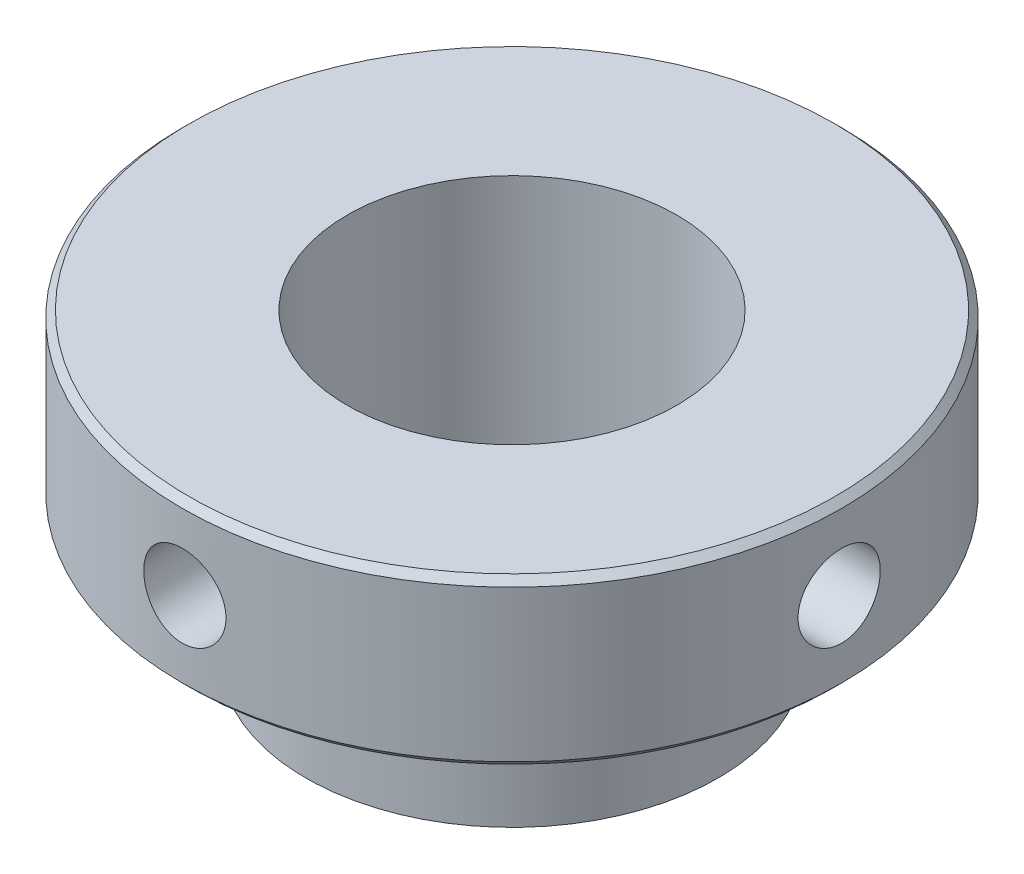
ISO-10303-21;
HEADER;
FILE_DESCRIPTION(('STEP AP214'),'2;1');
FILE_NAME('part.step','',(''),(''),'','','');
FILE_SCHEMA(('AUTOMOTIVE_DESIGN { 1 0 10303 214 1 1 1 1 }'));
ENDSEC;
DATA;
#1=APPLICATION_CONTEXT('core data for automotive mechanical design processes');
#2=APPLICATION_PROTOCOL_DEFINITION('international standard','automotive_design',2000,#1);
#3=PRODUCT_CONTEXT('',#1,'mechanical');
#4=PRODUCT('Part','Part','',(#3));
#5=PRODUCT_RELATED_PRODUCT_CATEGORY('part','',(#4));
#6=PRODUCT_DEFINITION_FORMATION('','',#4);
#7=PRODUCT_DEFINITION_CONTEXT('part definition',#1,'design');
#8=PRODUCT_DEFINITION('design','',#6,#7);
#9=PRODUCT_DEFINITION_SHAPE('','',#8);
#10=(LENGTH_UNIT() NAMED_UNIT(*) SI_UNIT(.MILLI.,.METRE.));
#11=(NAMED_UNIT(*) PLANE_ANGLE_UNIT() SI_UNIT($,.RADIAN.));
#12=(NAMED_UNIT(*) SI_UNIT($,.STERADIAN.) SOLID_ANGLE_UNIT());
#13=UNCERTAINTY_MEASURE_WITH_UNIT(LENGTH_MEASURE(1.E-05),#10,'distance_accuracy_value','');
#14=(GEOMETRIC_REPRESENTATION_CONTEXT(3) GLOBAL_UNCERTAINTY_ASSIGNED_CONTEXT((#13)) GLOBAL_UNIT_ASSIGNED_CONTEXT((#10,
#11,#12)) REPRESENTATION_CONTEXT('',''));
#15=CARTESIAN_POINT('',(0.,0.,0.));
#16=DIRECTION('',(0.,0.,1.));
#17=DIRECTION('',(1.,0.,0.));
#18=AXIS2_PLACEMENT_3D('',#15,#16,#17);
#19=CARTESIAN_POINT('',(0.,0.,0.));
#20=DIRECTION('',(0.,-1.,0.));
#21=DIRECTION('',(0.,0.,-1.));
#22=AXIS2_PLACEMENT_3D('',#19,#20,#21);
#23=CYLINDRICAL_SURFACE('',#22,3.);
#24=CARTESIAN_POINT('',(2.97659604246193,2.,-0.374));
#25=CARTESIAN_POINT('',(2.9765963422719,1.97908002096411,-0.373999110309325));
#26=CARTESIAN_POINT('',(2.97681896704147,1.95814695575955,-0.372238814554709));
#27=CARTESIAN_POINT('',(2.97768507797581,1.91686336385683,-0.365244460648864));
#28=CARTESIAN_POINT('',(2.97832900426937,1.89651346962265,-0.360006769618858));
#29=CARTESIAN_POINT('',(2.9799636748581,1.8569999178447,-0.346214406960289));
#30=CARTESIAN_POINT('',(2.98095418409294,1.83783546664757,-0.337661983035738));
#31=CARTESIAN_POINT('',(2.98317013177889,1.80121736972644,-0.317487728900767));
#32=CARTESIAN_POINT('',(2.98439552996269,1.783763431541,-0.305866424663567));
#33=CARTESIAN_POINT('',(2.98695082448385,1.75096106298891,-0.279814985764893));
#34=CARTESIAN_POINT('',(2.98828121009916,1.73562353282838,-0.265371172713526));
#35=CARTESIAN_POINT('',(2.99089217758698,1.70758350768693,-0.234114162677506));
#36=CARTESIAN_POINT('',(2.9921727569822,1.69488114364038,-0.217300848028311));
#37=CARTESIAN_POINT('',(2.99454482864878,1.67243295131177,-0.181713625519564));
#38=CARTESIAN_POINT('',(2.99563568518879,1.66269698403908,-0.162933451418036));
#39=CARTESIAN_POINT('',(2.99750002464498,1.6465211137916,-0.123988774347822));
#40=CARTESIAN_POINT('',(2.99827351928006,1.64008108910868,-0.103824322527073));
#41=CARTESIAN_POINT('',(2.99941253748433,1.63071246964524,-0.0627949384780372));
#42=CARTESIAN_POINT('',(2.99978016543772,1.62776575640893,-0.0419342027587658));
#43=CARTESIAN_POINT('',(3.00007321402063,1.62541125586951,-1.12977531221159E-05));
#44=CARTESIAN_POINT('',(2.99999865195891,1.62600333004675,0.0210508636165751));
#45=CARTESIAN_POINT('',(2.99941742466199,1.63069507421044,0.0626554740730173));
#46=CARTESIAN_POINT('',(2.99891315996738,1.63477525822432,0.0832001588427727));
#47=CARTESIAN_POINT('',(2.99753188538731,1.64629694157758,0.123310901643888));
#48=CARTESIAN_POINT('',(2.99665486844761,1.6537385045303,0.142876941146827));
#49=CARTESIAN_POINT('',(2.99462250037944,1.67179243855339,0.180535325882905));
#50=CARTESIAN_POINT('',(2.99346641038458,1.68241324512918,0.198623585527014));
#51=CARTESIAN_POINT('',(2.99100524293599,1.70651804417715,0.232768383354013));
#52=CARTESIAN_POINT('',(2.98970015868685,1.72000216726497,0.248824828798488));
#53=CARTESIAN_POINT('',(2.98707659092304,1.74955997814411,0.278564687848935));
#54=CARTESIAN_POINT('',(2.98575807663327,1.76565064749604,0.292231226667685));
#55=CARTESIAN_POINT('',(2.9832650121254,1.79990645204658,0.316672186233087));
#56=CARTESIAN_POINT('',(2.98209046235424,1.8180715936852,0.327446598001055));
#57=CARTESIAN_POINT('',(2.98001832245345,1.85597570797535,0.345798408292956));
#58=CARTESIAN_POINT('',(2.97912084909504,1.87571533978283,0.353374459391067));
#59=CARTESIAN_POINT('',(2.97770675449528,1.91620030678288,0.365099549784297));
#60=CARTESIAN_POINT('',(2.97719011500078,1.93694559372418,0.369248753327407));
#61=CARTESIAN_POINT('',(2.97659951650018,1.9787039642979,0.373980028919209));
#62=CARTESIAN_POINT('',(2.97652261069209,1.99971431738133,0.374585847004368));
#63=CARTESIAN_POINT('',(2.9768123936368,2.0415370202136,0.372275804941478));
#64=CARTESIAN_POINT('',(2.97717907298625,2.06234937415031,0.369360019446307));
#65=CARTESIAN_POINT('',(2.97831202162864,2.10311415862273,0.360109530306638));
#66=CARTESIAN_POINT('',(2.97907694721078,2.12306923807232,0.35378632105132));
#67=CARTESIAN_POINT('',(2.98091911043126,2.16163588408346,0.337912307992426));
#68=CARTESIAN_POINT('',(2.98199635898695,2.18024740365211,0.328361391361537));
#69=CARTESIAN_POINT('',(2.98434884846455,2.21570606327593,0.306244678601096));
#70=CARTESIAN_POINT('',(2.98562509976905,2.23254342090922,0.293663308010206));
#71=CARTESIAN_POINT('',(2.98822861820608,2.26387600208658,0.265864847201817));
#72=CARTESIAN_POINT('',(2.98955588731067,2.27837113498099,0.250647655018965));
#73=CARTESIAN_POINT('',(2.99212094044646,2.30469119679681,0.217905790163987));
#74=CARTESIAN_POINT('',(2.99335817458228,2.31650052386837,0.200368526463806));
#75=CARTESIAN_POINT('',(2.99559553374754,2.3370058038405,0.163545583795214));
#76=CARTESIAN_POINT('',(2.99659566353432,2.34570181920934,0.144259939917595));
#77=CARTESIAN_POINT('',(2.99824368451605,2.35970785437416,0.104539569135229));
#78=CARTESIAN_POINT('',(2.99889251365513,2.36502689703963,0.0841080643633984));
#79=CARTESIAN_POINT('',(2.99976872173339,2.37215735191806,0.0426333380772617));
#80=CARTESIAN_POINT('',(2.99999611957106,2.37396892141888,0.0215901440362809));
#81=CARTESIAN_POINT('',(3.00000375559385,2.37403007755408,-0.0203582668458081));
#82=CARTESIAN_POINT('',(2.99978701418194,2.37230372409666,-0.0412634521444337));
#83=CARTESIAN_POINT('',(2.99893672838106,2.36538898941673,-0.0824841152228694));
#84=CARTESIAN_POINT('',(2.99830318427124,2.36020061051278,-0.102799593397607));
#85=CARTESIAN_POINT('',(2.99669016687359,2.34651664588869,-0.142261051211945));
#86=CARTESIAN_POINT('',(2.99571081345379,2.33802220604561,-0.161407433401814));
#87=CARTESIAN_POINT('',(2.99351463161352,2.31796973875746,-0.198006768257339));
#88=CARTESIAN_POINT('',(2.99229780043085,2.30641167567767,-0.215459701222317));
#89=CARTESIAN_POINT('',(2.98975262511752,2.28047101690636,-0.248299636922905));
#90=CARTESIAN_POINT('',(2.98842360642369,2.26607051821591,-0.263672446401855));
#91=CARTESIAN_POINT('',(2.98580926209895,2.23489092445359,-0.291792793696697));
#92=CARTESIAN_POINT('',(2.98452394689405,2.21811126667212,-0.304539708691603));
#93=CARTESIAN_POINT('',(2.98213727308625,2.18257578897051,-0.327088260193843));
#94=CARTESIAN_POINT('',(2.98103664009431,2.16381262548976,-0.336878394712667));
#95=CARTESIAN_POINT('',(2.97915245638795,2.12490534261998,-0.353154891762453));
#96=CARTESIAN_POINT('',(2.97836856081294,2.10476275324416,-0.359644849495394));
#97=CARTESIAN_POINT('',(2.97739704926068,2.07042981465918,-0.367582077097384));
#98=CARTESIAN_POINT('',(2.97709816661237,2.05645606757413,-0.369985339637448));
#99=CARTESIAN_POINT('',(2.97669756245576,2.02832354586978,-0.373194596276032));
#100=CARTESIAN_POINT('',(2.97659583946267,2.01416477264471,-0.374000602403383));
#101=CARTESIAN_POINT('',(2.97659604246193,2.,-0.374));
#102=B_SPLINE_CURVE_WITH_KNOTS('',3,(#24,#25,#26,#27,#28,#29,#30,#31,#32,#33,#34,#35,#36,#37,
#38,#39,#40,#41,#42,#43,#44,#45,#46,#47,#48,#49,#50,#51,#52,#53,#54,#55,#56,#57,#58,#59,#60,#61,
#62,#63,#64,#65,#66,#67,#68,#69,#70,#71,#72,#73,#74,#75,#76,#77,#78,#79,#80,#81,#82,#83,#84,#85,
#86,#87,#88,#89,#90,#91,#92,#93,#94,#95,#96,#97,#98,#99,#100,#101),.UNSPECIFIED.,.T.,.F.,(4,2,2,
2,2,2,2,2,2,2,2,2,2,2,2,2,2,2,2,2,2,2,2,2,2,2,2,2,2,2,2,2,2,2,2,2,2,2,4),(0.,0.0627081910267501,
0.12548199739714,0.188213311423225,0.250933880943967,0.313966301159942,0.377001852539022,
0.440244718622654,0.503485249190176,0.566396320192973,0.62930492866815,0.691864384010811,
0.754425023326458,0.817153149078171,0.879884136907698,0.943041591862344,1.00619924288867,
1.06938347488587,1.13256467830203,1.19532198265547,1.25807795666862,1.32062354684867,
1.38317132359029,1.44604768198915,1.50892647326989,1.5721616939239,1.63539564569893,
1.69845992484583,1.76152137589576,1.82415539617802,1.88678937451328,1.94940166328554,
2.0120146803682,2.07503542815998,2.13807110631822,2.20134892761232,2.26455766577012,
2.30701726655353,2.34947654757532),.UNSPECIFIED.);
#103=CARTESIAN_POINT('',(2.97659604246193,2.,-0.374));
#104=VERTEX_POINT('',#103);
#105=EDGE_CURVE('E112',#104,#104,#102,.T.);
#106=ORIENTED_EDGE('',*,*,#105,.T.);
#107=EDGE_LOOP('',(#106));
#108=FACE_BOUND('',#107,.T.);
#109=CARTESIAN_POINT('',(-2.97659604246193,2.,0.374));
#110=CARTESIAN_POINT('',(-2.9765963422719,1.97908002096411,0.373999110309325));
#111=CARTESIAN_POINT('',(-2.97681896704147,1.95814695575955,0.372238814554709));
#112=CARTESIAN_POINT('',(-2.97768507797581,1.91686336385683,0.365244460648864));
#113=CARTESIAN_POINT('',(-2.97832900426937,1.89651346962265,0.360006769618858));
#114=CARTESIAN_POINT('',(-2.9799636748581,1.8569999178447,0.346214406960289));
#115=CARTESIAN_POINT('',(-2.98095418409294,1.83783546664757,0.337661983035738));
#116=CARTESIAN_POINT('',(-2.98317013177889,1.80121736972644,0.317487728900767));
#117=CARTESIAN_POINT('',(-2.98439552996269,1.783763431541,0.305866424663567));
#118=CARTESIAN_POINT('',(-2.98695082448385,1.75096106298891,0.279814985764893));
#119=CARTESIAN_POINT('',(-2.98828121009916,1.73562353282838,0.265371172713526));
#120=CARTESIAN_POINT('',(-2.99089217758698,1.70758350768693,0.234114162677506));
#121=CARTESIAN_POINT('',(-2.9921727569822,1.69488114364038,0.217300848028311));
#122=CARTESIAN_POINT('',(-2.99454482864878,1.67243295131177,0.181713625519564));
#123=CARTESIAN_POINT('',(-2.99563568518879,1.66269698403908,0.162933451418036));
#124=CARTESIAN_POINT('',(-2.99750002464498,1.6465211137916,0.123988774347822));
#125=CARTESIAN_POINT('',(-2.99827351928006,1.64008108910868,0.103824322527073));
#126=CARTESIAN_POINT('',(-2.99941253748433,1.63071246964524,0.0627949384780372));
#127=CARTESIAN_POINT('',(-2.99978016543772,1.62776575640893,0.0419342027587658));
#128=CARTESIAN_POINT('',(-3.00007321402063,1.62541125586951,1.12977531221159E-05));
#129=CARTESIAN_POINT('',(-2.99999865195891,1.62600333004675,-0.0210508636165751));
#130=CARTESIAN_POINT('',(-2.99941742466199,1.63069507421044,-0.0626554740730173));
#131=CARTESIAN_POINT('',(-2.99891315996738,1.63477525822432,-0.0832001588427727));
#132=CARTESIAN_POINT('',(-2.99753188538731,1.64629694157758,-0.123310901643888));
#133=CARTESIAN_POINT('',(-2.99665486844761,1.6537385045303,-0.142876941146827));
#134=CARTESIAN_POINT('',(-2.99462250037944,1.67179243855339,-0.180535325882905));
#135=CARTESIAN_POINT('',(-2.99346641038458,1.68241324512918,-0.198623585527014));
#136=CARTESIAN_POINT('',(-2.99100524293599,1.70651804417715,-0.232768383354013));
#137=CARTESIAN_POINT('',(-2.98970015868685,1.72000216726497,-0.248824828798488));
#138=CARTESIAN_POINT('',(-2.98707659092304,1.74955997814411,-0.278564687848935));
#139=CARTESIAN_POINT('',(-2.98575807663327,1.76565064749604,-0.292231226667685));
#140=CARTESIAN_POINT('',(-2.9832650121254,1.79990645204658,-0.316672186233087));
#141=CARTESIAN_POINT('',(-2.98209046235424,1.8180715936852,-0.327446598001055));
#142=CARTESIAN_POINT('',(-2.98001832245345,1.85597570797535,-0.345798408292956));
#143=CARTESIAN_POINT('',(-2.97912084909504,1.87571533978283,-0.353374459391067));
#144=CARTESIAN_POINT('',(-2.97770675449528,1.91620030678288,-0.365099549784297));
#145=CARTESIAN_POINT('',(-2.97719011500078,1.93694559372418,-0.369248753327407));
#146=CARTESIAN_POINT('',(-2.97659951650018,1.9787039642979,-0.373980028919209));
#147=CARTESIAN_POINT('',(-2.97652261069209,1.99971431738133,-0.374585847004368));
#148=CARTESIAN_POINT('',(-2.9768123936368,2.0415370202136,-0.372275804941478));
#149=CARTESIAN_POINT('',(-2.97717907298625,2.06234937415031,-0.369360019446307));
#150=CARTESIAN_POINT('',(-2.97831202162864,2.10311415862273,-0.360109530306638));
#151=CARTESIAN_POINT('',(-2.97907694721078,2.12306923807232,-0.35378632105132));
#152=CARTESIAN_POINT('',(-2.98091911043126,2.16163588408346,-0.337912307992426));
#153=CARTESIAN_POINT('',(-2.98199635898695,2.18024740365211,-0.328361391361537));
#154=CARTESIAN_POINT('',(-2.98434884846455,2.21570606327593,-0.306244678601096));
#155=CARTESIAN_POINT('',(-2.98562509976905,2.23254342090922,-0.293663308010206));
#156=CARTESIAN_POINT('',(-2.98822861820608,2.26387600208658,-0.265864847201817));
#157=CARTESIAN_POINT('',(-2.98955588731067,2.27837113498099,-0.250647655018965));
#158=CARTESIAN_POINT('',(-2.99212094044646,2.30469119679681,-0.217905790163987));
#159=CARTESIAN_POINT('',(-2.99335817458228,2.31650052386837,-0.200368526463806));
#160=CARTESIAN_POINT('',(-2.99559553374754,2.3370058038405,-0.163545583795214));
#161=CARTESIAN_POINT('',(-2.99659566353432,2.34570181920934,-0.144259939917595));
#162=CARTESIAN_POINT('',(-2.99824368451605,2.35970785437416,-0.104539569135229));
#163=CARTESIAN_POINT('',(-2.99889251365513,2.36502689703963,-0.0841080643633984));
#164=CARTESIAN_POINT('',(-2.99976872173339,2.37215735191806,-0.0426333380772617));
#165=CARTESIAN_POINT('',(-2.99999611957106,2.37396892141888,-0.0215901440362809));
#166=CARTESIAN_POINT('',(-3.00000375559385,2.37403007755408,0.0203582668458081));
#167=CARTESIAN_POINT('',(-2.99978701418194,2.37230372409666,0.0412634521444337));
#168=CARTESIAN_POINT('',(-2.99893672838106,2.36538898941673,0.0824841152228694));
#169=CARTESIAN_POINT('',(-2.99830318427124,2.36020061051278,0.102799593397607));
#170=CARTESIAN_POINT('',(-2.99669016687359,2.34651664588869,0.142261051211945));
#171=CARTESIAN_POINT('',(-2.99571081345379,2.33802220604561,0.161407433401814));
#172=CARTESIAN_POINT('',(-2.99351463161352,2.31796973875746,0.198006768257339));
#173=CARTESIAN_POINT('',(-2.99229780043085,2.30641167567767,0.215459701222317));
#174=CARTESIAN_POINT('',(-2.98975262511752,2.28047101690636,0.248299636922905));
#175=CARTESIAN_POINT('',(-2.98842360642369,2.26607051821591,0.263672446401855));
#176=CARTESIAN_POINT('',(-2.98580926209895,2.23489092445359,0.291792793696697));
#177=CARTESIAN_POINT('',(-2.98452394689405,2.21811126667212,0.304539708691603));
#178=CARTESIAN_POINT('',(-2.98213727308625,2.18257578897051,0.327088260193843));
#179=CARTESIAN_POINT('',(-2.98103664009431,2.16381262548976,0.336878394712667));
#180=CARTESIAN_POINT('',(-2.97915245638795,2.12490534261998,0.353154891762453));
#181=CARTESIAN_POINT('',(-2.97836856081294,2.10476275324416,0.359644849495394));
#182=CARTESIAN_POINT('',(-2.97739704926068,2.07042981465918,0.367582077097384));
#183=CARTESIAN_POINT('',(-2.97709816661237,2.05645606757413,0.369985339637448));
#184=CARTESIAN_POINT('',(-2.97669756245576,2.02832354586978,0.373194596276032));
#185=CARTESIAN_POINT('',(-2.97659583946267,2.01416477264471,0.374000602403383));
#186=CARTESIAN_POINT('',(-2.97659604246193,2.,0.374));
#187=B_SPLINE_CURVE_WITH_KNOTS('',3,(#109,#110,#111,#112,#113,#114,#115,#116,#117,#118,#119,
#120,#121,#122,#123,#124,#125,#126,#127,#128,#129,#130,#131,#132,#133,#134,#135,#136,#137,#138,
#139,#140,#141,#142,#143,#144,#145,#146,#147,#148,#149,#150,#151,#152,#153,#154,#155,#156,#157,
#158,#159,#160,#161,#162,#163,#164,#165,#166,#167,#168,#169,#170,#171,#172,#173,#174,#175,#176,
#177,#178,#179,#180,#181,#182,#183,#184,#185,#186),.UNSPECIFIED.,.T.,.F.,(4,2,2,2,2,2,2,2,2,2,2,
2,2,2,2,2,2,2,2,2,2,2,2,2,2,2,2,2,2,2,2,2,2,2,2,2,2,2,4),(0.,0.0627081910267501,
0.12548199739714,0.188213311423225,0.250933880943967,0.313966301159942,0.377001852539022,
0.440244718622654,0.503485249190176,0.566396320192973,0.62930492866815,0.691864384010811,
0.754425023326458,0.817153149078171,0.879884136907698,0.943041591862344,1.00619924288867,
1.06938347488587,1.13256467830203,1.19532198265547,1.25807795666862,1.32062354684867,
1.38317132359029,1.44604768198915,1.50892647326989,1.5721616939239,1.63539564569893,
1.69845992484583,1.76152137589576,1.82415539617802,1.88678937451328,1.94940166328554,
2.0120146803682,2.07503542815998,2.13807110631822,2.20134892761232,2.26455766577012,
2.30701726655353,2.34947654757532),.UNSPECIFIED.);
#188=CARTESIAN_POINT('',(-2.97659604246193,2.,0.374));
#189=VERTEX_POINT('',#188);
#190=EDGE_CURVE('E100',#189,#189,#187,.T.);
#191=ORIENTED_EDGE('',*,*,#190,.T.);
#192=EDGE_LOOP('',(#191));
#193=FACE_BOUND('',#192,.T.);
#194=CARTESIAN_POINT('',(0.,2.688,0.));
#195=DIRECTION('',(0.,-1.,0.));
#196=DIRECTION('',(0.,0.,-1.));
#197=AXIS2_PLACEMENT_3D('',#194,#195,#196);
#198=CIRCLE('',#197,3.);
#199=CARTESIAN_POINT('',(0.,2.688,-3.));
#200=VERTEX_POINT('',#199);
#201=EDGE_CURVE('E166',#200,#200,#198,.T.);
#202=ORIENTED_EDGE('',*,*,#201,.T.);
#203=EDGE_LOOP('',(#202));
#204=FACE_BOUND('',#203,.T.);
#205=CARTESIAN_POINT('',(0.,1.312,0.));
#206=DIRECTION('',(0.,-1.,0.));
#207=DIRECTION('',(0.,0.,-1.));
#208=AXIS2_PLACEMENT_3D('',#205,#206,#207);
#209=CIRCLE('',#208,3.);
#210=CARTESIAN_POINT('',(0.,1.312,-3.));
#211=VERTEX_POINT('',#210);
#212=EDGE_CURVE('E158',#211,#211,#209,.T.);
#213=ORIENTED_EDGE('',*,*,#212,.F.);
#214=EDGE_LOOP('',(#213));
#215=FACE_BOUND('',#214,.T.);
#216=CARTESIAN_POINT('',(0.,2.374,-3.));
#217=CARTESIAN_POINT('',(-0.0209206912447897,2.37399911093565,-2.99999970875538));
#218=CARTESIAN_POINT('',(-0.041854466564667,2.37223869936918,-2.99977885096707));
#219=CARTESIAN_POINT('',(-0.0831395337639532,2.36524384366907,-2.99891904960694));
#220=CARTESIAN_POINT('',(-0.103490193740075,2.360005769166,-2.99827966914465));
#221=CARTESIAN_POINT('',(-0.143005365165185,2.3462122848672,-2.99665485422549));
#222=CARTESIAN_POINT('',(-0.162170663784758,2.33765910458859,-2.99566965238673));
#223=CARTESIAN_POINT('',(-0.198790182351024,2.31748306894102,-2.99346277789071));
#224=CARTESIAN_POINT('',(-0.216244695800104,2.30586074138349,-2.99224114590277));
#225=CARTESIAN_POINT('',(-0.249046421902186,2.27980826578294,-2.98969033035591));
#226=CARTESIAN_POINT('',(-0.264382914875163,2.26536466824449,-2.9883606501821));
#227=CARTESIAN_POINT('',(-0.292420936183478,2.23410852567968,-2.98574760728332));
#228=CARTESIAN_POINT('',(-0.305122330400318,2.21729586014808,-2.98446424691863));
#229=CARTESIAN_POINT('',(-0.327569502921966,2.18170921345759,-2.9820842569232));
#230=CARTESIAN_POINT('',(-0.337305243654575,2.16292885439118,-2.98098826683936));
#231=CARTESIAN_POINT('',(-0.353480644153368,2.1239837755305,-2.97911364988601));
#232=CARTESIAN_POINT('',(-0.359920428258781,2.10381910799153,-2.97833501104472));
#233=CARTESIAN_POINT('',(-0.3692885533571,2.06278903466297,-2.97718799363862));
#234=CARTESIAN_POINT('',(-0.372234988938892,2.04192782040117,-2.97681750169869));
#235=CARTESIAN_POINT('',(-0.374588768335433,2.00000397628447,-2.97652225649842));
#236=CARTESIAN_POINT('',(-0.373996253738406,1.97894135452124,-2.97659748540542));
#237=CARTESIAN_POINT('',(-0.369303806600248,1.93733867109031,-2.97718324807485));
#238=CARTESIAN_POINT('',(-0.365223803580784,1.91679632175769,-2.97769130833427));
#239=CARTESIAN_POINT('',(-0.353703289523987,1.87669015616448,-2.97908162971462));
#240=CARTESIAN_POINT('',(-0.346262710730996,1.85712635964223,-2.97996389838028));
#241=CARTESIAN_POINT('',(-0.328210826066133,1.81947071591669,-2.98200603164207));
#242=CARTESIAN_POINT('',(-0.317590856991984,1.8013830645112,-2.98316665295244));
#243=CARTESIAN_POINT('',(-0.293487851665837,1.76723912911846,-2.98563413214075));
#244=CARTESIAN_POINT('',(-0.280004685152017,1.751182937606,-2.98694099667077));
#245=CARTESIAN_POINT('',(-0.250447559914594,1.72144201936917,-2.98956470640396));
#246=CARTESIAN_POINT('',(-0.234356422552244,1.70777435993261,-2.99088155844042));
#247=CARTESIAN_POINT('',(-0.200099279822698,1.68333136133428,-2.99336845662882));
#248=CARTESIAN_POINT('',(-0.181933269714494,1.67255602878156,-2.9945385024453));
#249=CARTESIAN_POINT('',(-0.144028905381121,1.65420355321203,-2.99660067638884));
#250=CARTESIAN_POINT('',(-0.124290029814825,1.64662747590432,-2.99749271188154));
#251=CARTESIAN_POINT('',(-0.0838067087876765,1.63490210202707,-2.99889751453592));
#252=CARTESIAN_POINT('',(-0.063062310199059,1.63075264588866,-2.9994102993582));
#253=CARTESIAN_POINT('',(-0.0213043761304926,1.62602041591158,-2.9999965281996));
#254=CARTESIAN_POINT('',(-0.000293544172885351,1.62541413038067,-3.0000728682952));
#255=CARTESIAN_POINT('',(0.0415302281507634,1.62772340845586,-2.99978542468937));
#256=CARTESIAN_POINT('',(0.062343172698754,1.63063889746893,-2.99942165030981));
#257=CARTESIAN_POINT('',(0.103111013955605,1.63988943304573,-2.99829665874524));
#258=CARTESIAN_POINT('',(0.123068492786546,1.64621327192813,-2.99753674445469));
#259=CARTESIAN_POINT('',(0.161639659586872,1.66208934628217,-2.99570455454915));
#260=CARTESIAN_POINT('',(0.180253302123682,1.67164169084152,-2.99463226837962));
#261=CARTESIAN_POINT('',(0.215713446053781,1.69376052646705,-2.99228766987947));
#262=CARTESIAN_POINT('',(0.232550391448334,1.70634222977601,-2.99101435956522));
#263=CARTESIAN_POINT('',(0.26388198626782,1.73414110884769,-2.98841327981736));
#264=CARTESIAN_POINT('',(0.278376543187384,1.7493583886452,-2.98708550823556));
#265=CARTESIAN_POINT('',(0.304695306283149,1.78210001015028,-2.98451622242239));
#266=CARTESIAN_POINT('',(0.316503929457945,1.79963692570348,-2.98327523910348));
#267=CARTESIAN_POINT('',(0.33700797523824,1.83645897920894,-2.98102875976276));
#268=CARTESIAN_POINT('',(0.34570345997212,1.85574408226329,-2.98002325904161));
#269=CARTESIAN_POINT('',(0.359709155686828,1.89546475069022,-2.9783652009512));
#270=CARTESIAN_POINT('',(0.365028159647416,1.91589717574647,-2.97771172751605));
#271=CARTESIAN_POINT('',(0.372158225473697,1.9573738473135,-2.97682908051385));
#272=CARTESIAN_POINT('',(0.373969449591364,1.97841806548015,-2.97659988732177));
#273=CARTESIAN_POINT('',(0.374029575819987,2.02036592562242,-2.97659232009948));
#274=CARTESIAN_POINT('',(0.37230295956238,2.04126953617328,-2.97681084786756));
#275=CARTESIAN_POINT('',(0.365388252254776,2.08248698287863,-2.97766743966918));
#276=CARTESIAN_POINT('',(0.360200160772869,2.10280081895953,-2.97830550375506));
#277=CARTESIAN_POINT('',(0.346517415009544,2.14225890460569,-2.9799283174653));
#278=CARTESIAN_POINT('',(0.338023933237664,2.16140356612522,-2.98091294414291));
#279=CARTESIAN_POINT('',(0.317973916489239,2.19799985783531,-2.98311814412163));
#280=CARTESIAN_POINT('',(0.306417343940671,2.21545146725522,-2.98433872031688));
#281=CARTESIAN_POINT('',(0.280478351122303,2.24829141666742,-2.98688841020212));
#282=CARTESIAN_POINT('',(0.266077685233841,2.26366529440331,-2.9882181904732));
#283=CARTESIAN_POINT('',(0.234897313924434,2.2917877191066,-2.99083056747977));
#284=CARTESIAN_POINT('',(0.218117048255458,2.30453564608717,-2.99211315301402));
#285=CARTESIAN_POINT('',(0.182581049141908,2.32708531791436,-2.99449198156727));
#286=CARTESIAN_POINT('',(0.163818082419658,2.33687573454369,-2.99558750127327));
#287=CARTESIAN_POINT('',(0.124911211181414,2.35315281310212,-2.99746142214692));
#288=CARTESIAN_POINT('',(0.10476883518223,2.35964306680577,-2.99824016789406));
#289=CARTESIAN_POINT('',(0.070435109288303,2.36758110646841,-2.99920496050315));
#290=CARTESIAN_POINT('',(0.056460304453018,2.36998473443705,-2.99950164870135));
#291=CARTESIAN_POINT('',(0.0283256651578641,2.3731944763575,-2.99989926633713));
#292=CARTESIAN_POINT('',(0.0141658320532602,2.37400060200383,-3.00000019720775));
#293=CARTESIAN_POINT('',(0.,2.374,-3.));
#294=B_SPLINE_CURVE_WITH_KNOTS('',3,(#216,#217,#218,#219,#220,#221,#222,#223,#224,#225,#226,
#227,#228,#229,#230,#231,#232,#233,#234,#235,#236,#237,#238,#239,#240,#241,#242,#243,#244,#245,
#246,#247,#248,#249,#250,#251,#252,#253,#254,#255,#256,#257,#258,#259,#260,#261,#262,#263,#264,
#265,#266,#267,#268,#269,#270,#271,#272,#273,#274,#275,#276,#277,#278,#279,#280,#281,#282,#283,
#284,#285,#286,#287,#288,#289,#290,#291,#292,#293),.UNSPECIFIED.,.T.,.F.,(4,2,2,2,2,2,2,2,2,2,2,
2,2,2,2,2,2,2,2,2,2,2,2,2,2,2,2,2,2,2,2,2,2,2,2,2,2,2,4),(0.,0.0627103306104441,
0.125486228352583,0.188219980302256,0.250942950738426,0.313972570556847,0.377005397604239,
0.440249254387269,0.503490725133998,0.566403171015023,0.6293130998779,0.691865910301921,
0.754419981966977,0.817146076773248,0.879875025929165,0.94303534699095,1.00619581237463,
1.06937730067812,1.1325558466174,1.19531467345817,1.25807217105722,1.32062455104941,
1.38317904483042,1.4460544658878,1.50893236940849,1.57216626112007,1.63539889081312,
1.69846616811525,1.76153052817769,1.82415996091172,1.88678940146046,1.94939664590726,
2.01200465833316,2.0750281891663,2.13806658283987,2.20134345849642,2.2645513177515,
2.30701408842385,2.34947654824593),.UNSPECIFIED.);
#295=CARTESIAN_POINT('',(0.,2.374,-3.));
#296=VERTEX_POINT('',#295);
#297=EDGE_CURVE('E107',#296,#296,#294,.T.);
#298=ORIENTED_EDGE('',*,*,#297,.T.);
#299=EDGE_LOOP('',(#298));
#300=FACE_BOUND('',#299,.T.);
#301=CARTESIAN_POINT('',(0.373999999999969,2.,2.97659604246193));
#302=CARTESIAN_POINT('',(0.373999110309294,1.97908002096411,2.9765963422719));
#303=CARTESIAN_POINT('',(0.372238814554678,1.95814695575955,2.97681896704148));
#304=CARTESIAN_POINT('',(0.365244460648833,1.91686336385683,2.97768507797582));
#305=CARTESIAN_POINT('',(0.360006769618827,1.89651346962265,2.97832900426937));
#306=CARTESIAN_POINT('',(0.346214406960258,1.8569999178447,2.9799636748581));
#307=CARTESIAN_POINT('',(0.337661983035707,1.83783546664757,2.98095418409294));
#308=CARTESIAN_POINT('',(0.317487728900736,1.80121736972644,2.98317013177889));
#309=CARTESIAN_POINT('',(0.305866424663536,1.783763431541,2.98439552996269));
#310=CARTESIAN_POINT('',(0.279814985764862,1.75096106298891,2.98695082448386));
#311=CARTESIAN_POINT('',(0.265371172713494,1.73562353282838,2.98828121009916));
#312=CARTESIAN_POINT('',(0.234114162677475,1.70758350768693,2.99089217758699));
#313=CARTESIAN_POINT('',(0.21730084802828,1.69488114364038,2.9921727569822));
#314=CARTESIAN_POINT('',(0.181713625519533,1.67243295131177,2.99454482864878));
#315=CARTESIAN_POINT('',(0.162933451418005,1.66269698403908,2.99563568518879));
#316=CARTESIAN_POINT('',(0.12398877434779,1.6465211137916,2.99750002464498));
#317=CARTESIAN_POINT('',(0.103824322527042,1.64008108910868,2.99827351928006));
#318=CARTESIAN_POINT('',(0.0627949384780059,1.63071246964524,2.99941253748433));
#319=CARTESIAN_POINT('',(0.0419342027587344,1.62776575640893,2.99978016543772));
#320=CARTESIAN_POINT('',(1.12977530907079E-05,1.62541125586951,3.00007321402063));
#321=CARTESIAN_POINT('',(-0.0210508636166065,1.62600333004675,2.99999865195891));
#322=CARTESIAN_POINT('',(-0.0626554740730488,1.63069507421044,2.99941742466199));
#323=CARTESIAN_POINT('',(-0.0832001588428042,1.63477525822432,2.99891315996738));
#324=CARTESIAN_POINT('',(-0.12331090164392,1.64629694157758,2.99753188538731));
#325=CARTESIAN_POINT('',(-0.142876941146858,1.6537385045303,2.99665486844761));
#326=CARTESIAN_POINT('',(-0.180535325882936,1.67179243855339,2.99462250037944));
#327=CARTESIAN_POINT('',(-0.198623585527045,1.68241324512918,2.99346641038458));
#328=CARTESIAN_POINT('',(-0.232768383354045,1.70651804417715,2.99100524293599));
#329=CARTESIAN_POINT('',(-0.248824828798519,1.72000216726497,2.98970015868685));
#330=CARTESIAN_POINT('',(-0.278564687848966,1.74955997814411,2.98707659092304));
#331=CARTESIAN_POINT('',(-0.292231226667717,1.76565064749604,2.98575807663327));
#332=CARTESIAN_POINT('',(-0.316672186233118,1.79990645204658,2.9832650121254));
#333=CARTESIAN_POINT('',(-0.327446598001086,1.8180715936852,2.98209046235424));
#334=CARTESIAN_POINT('',(-0.345798408292987,1.85597570797534,2.98001832245345));
#335=CARTESIAN_POINT('',(-0.353374459391098,1.87571533978283,2.97912084909503));
#336=CARTESIAN_POINT('',(-0.365099549784328,1.91620030678288,2.97770675449527));
#337=CARTESIAN_POINT('',(-0.369248753327439,1.93694559372418,2.97719011500077));
#338=CARTESIAN_POINT('',(-0.37398002891924,1.9787039642979,2.97659951650018));
#339=CARTESIAN_POINT('',(-0.374585847004399,1.99971431738133,2.97652261069208));
#340=CARTESIAN_POINT('',(-0.372275804941509,2.0415370202136,2.9768123936368));
#341=CARTESIAN_POINT('',(-0.369360019446338,2.06234937415031,2.97717907298625));
#342=CARTESIAN_POINT('',(-0.360109530306669,2.10311415862273,2.97831202162864));
#343=CARTESIAN_POINT('',(-0.353786321051352,2.12306923807232,2.97907694721078));
#344=CARTESIAN_POINT('',(-0.337912307992457,2.16163588408346,2.98091911043126));
#345=CARTESIAN_POINT('',(-0.328361391361568,2.18024740365211,2.98199635898694));
#346=CARTESIAN_POINT('',(-0.306244678601127,2.21570606327593,2.98434884846455));
#347=CARTESIAN_POINT('',(-0.293663308010237,2.23254342090922,2.98562509976904));
#348=CARTESIAN_POINT('',(-0.265864847201849,2.26387600208658,2.98822861820608));
#349=CARTESIAN_POINT('',(-0.250647655018996,2.27837113498099,2.98955588731067));
#350=CARTESIAN_POINT('',(-0.217905790164019,2.30469119679681,2.99212094044646));
#351=CARTESIAN_POINT('',(-0.200368526463837,2.31650052386837,2.99335817458228));
#352=CARTESIAN_POINT('',(-0.163545583795245,2.3370058038405,2.99559553374754));
#353=CARTESIAN_POINT('',(-0.144259939917626,2.34570181920934,2.99659566353432));
#354=CARTESIAN_POINT('',(-0.104539569135259,2.35970785437416,2.99824368451605));
#355=CARTESIAN_POINT('',(-0.0841080643634293,2.36502689703963,2.99889251365513));
#356=CARTESIAN_POINT('',(-0.0426333380772926,2.37215735191806,2.99976872173339));
#357=CARTESIAN_POINT('',(-0.021590144036312,2.37396892141888,2.99999611957106));
#358=CARTESIAN_POINT('',(0.0203582668457768,2.37403007755408,3.00000375559385));
#359=CARTESIAN_POINT('',(0.0412634521444025,2.37230372409666,2.99978701418194));
#360=CARTESIAN_POINT('',(0.0824841152228381,2.36538898941673,2.99893672838106));
#361=CARTESIAN_POINT('',(0.102799593397575,2.36020061051278,2.99830318427124));
#362=CARTESIAN_POINT('',(0.142261051211914,2.34651664588869,2.99669016687359));
#363=CARTESIAN_POINT('',(0.161407433401782,2.33802220604561,2.9957108134538));
#364=CARTESIAN_POINT('',(0.198006768257307,2.31796973875746,2.99351463161352));
#365=CARTESIAN_POINT('',(0.215459701222285,2.30641167567767,2.99229780043085));
#366=CARTESIAN_POINT('',(0.248299636922874,2.28047101690636,2.98975262511752));
#367=CARTESIAN_POINT('',(0.263672446401824,2.26607051821591,2.98842360642369));
#368=CARTESIAN_POINT('',(0.291792793696667,2.23489092445358,2.98580926209895));
#369=CARTESIAN_POINT('',(0.304539708691572,2.21811126667212,2.98452394689405));
#370=CARTESIAN_POINT('',(0.327088260193812,2.18257578897051,2.98213727308626));
#371=CARTESIAN_POINT('',(0.336878394712636,2.16381262548976,2.98103664009431));
#372=CARTESIAN_POINT('',(0.353154891762422,2.12490534261998,2.97915245638795));
#373=CARTESIAN_POINT('',(0.359644849495363,2.10476275324416,2.97836856081294));
#374=CARTESIAN_POINT('',(0.367582077097352,2.07042981465918,2.97739704926069));
#375=CARTESIAN_POINT('',(0.369985339637417,2.05645606757413,2.97709816661237));
#376=CARTESIAN_POINT('',(0.373194596276001,2.02832354586978,2.97669756245577));
#377=CARTESIAN_POINT('',(0.374000602403352,2.01416477264471,2.97659583946268));
#378=CARTESIAN_POINT('',(0.373999999999969,2.,2.97659604246193));
#379=B_SPLINE_CURVE_WITH_KNOTS('',3,(#301,#302,#303,#304,#305,#306,#307,#308,#309,#310,#311,
#312,#313,#314,#315,#316,#317,#318,#319,#320,#321,#322,#323,#324,#325,#326,#327,#328,#329,#330,
#331,#332,#333,#334,#335,#336,#337,#338,#339,#340,#341,#342,#343,#344,#345,#346,#347,#348,#349,
#350,#351,#352,#353,#354,#355,#356,#357,#358,#359,#360,#361,#362,#363,#364,#365,#366,#367,#368,
#369,#370,#371,#372,#373,#374,#375,#376,#377,#378),.UNSPECIFIED.,.T.,.F.,(4,2,2,2,2,2,2,2,2,2,2,
2,2,2,2,2,2,2,2,2,2,2,2,2,2,2,2,2,2,2,2,2,2,2,2,2,2,2,4),(0.,0.0627081910267501,
0.12548199739714,0.188213311423225,0.250933880943967,0.313966301159942,0.377001852539022,
0.440244718622654,0.503485249190176,0.566396320192973,0.62930492866815,0.691864384010811,
0.754425023326458,0.817153149078171,0.879884136907698,0.943041591862345,1.00619924288867,
1.06938347488587,1.13256467830203,1.19532198265547,1.25807795666862,1.32062354684867,
1.38317132359029,1.44604768198915,1.50892647326989,1.5721616939239,1.63539564569893,
1.69845992484583,1.76152137589576,1.82415539617802,1.88678937451328,1.94940166328554,
2.0120146803682,2.07503542815998,2.13807110631822,2.20134892761232,2.26455766577012,
2.30701726655353,2.34947654757532),.UNSPECIFIED.);
#380=CARTESIAN_POINT('',(0.373999999999969,2.,2.97659604246193));
#381=VERTEX_POINT('',#380);
#382=EDGE_CURVE('E42',#381,#381,#379,.T.);
#383=ORIENTED_EDGE('',*,*,#382,.T.);
#384=EDGE_LOOP('',(#383));
#385=FACE_BOUND('',#384,.T.);
#386=ADVANCED_FACE('F38',(#108,#193,#204,#215,#300,#385),#23,.T.);
#387=CARTESIAN_POINT('',(1.875,0.,0.));
#388=DIRECTION('',(0.,-1.,0.));
#389=DIRECTION('',(0.,0.,-1.));
#390=AXIS2_PLACEMENT_3D('',#387,#388,#389);
#391=PLANE('',#390);
#392=CARTESIAN_POINT('',(0.,0.,0.));
#393=DIRECTION('',(0.,-1.,0.));
#394=DIRECTION('',(0.,0.,-1.));
#395=AXIS2_PLACEMENT_3D('',#392,#393,#394);
#396=CIRCLE('',#395,1.875);
#397=CARTESIAN_POINT('',(0.,0.,-1.875));
#398=VERTEX_POINT('',#397);
#399=EDGE_CURVE('E156',#398,#398,#396,.T.);
#400=ORIENTED_EDGE('',*,*,#399,.T.);
#401=EDGE_LOOP('',(#400));
#402=FACE_BOUND('',#401,.T.);
#403=CARTESIAN_POINT('',(0.,0.,0.));
#404=DIRECTION('',(0.,-1.,0.));
#405=DIRECTION('',(0.,0.,-1.));
#406=AXIS2_PLACEMENT_3D('',#403,#404,#405);
#407=CIRCLE('',#406,1.5);
#408=CARTESIAN_POINT('',(0.,0.,-1.5));
#409=VERTEX_POINT('',#408);
#410=EDGE_CURVE('E12',#409,#409,#407,.T.);
#411=ORIENTED_EDGE('',*,*,#410,.F.);
#412=EDGE_LOOP('',(#411));
#413=FACE_BOUND('',#412,.T.);
#414=ADVANCED_FACE('F40',(#402,#413),#391,.T.);
#415=CARTESIAN_POINT('',(0.,0.,0.));
#416=DIRECTION('',(0.,-1.,0.));
#417=DIRECTION('',(0.,0.,-1.));
#418=AXIS2_PLACEMENT_3D('',#415,#416,#417);
#419=CYLINDRICAL_SURFACE('',#418,1.5);
#420=ORIENTED_EDGE('',*,*,#410,.T.);
#421=EDGE_LOOP('',(#420));
#422=FACE_BOUND('',#421,.T.);
#423=CARTESIAN_POINT('',(0.,2.75,0.));
#424=DIRECTION('',(0.,-1.,0.));
#425=DIRECTION('',(0.,0.,-1.));
#426=AXIS2_PLACEMENT_3D('',#423,#424,#425);
#427=CIRCLE('',#426,1.5);
#428=CARTESIAN_POINT('',(0.,2.75,-1.5));
#429=VERTEX_POINT('',#428);
#430=EDGE_CURVE('E52',#429,#429,#427,.T.);
#431=ORIENTED_EDGE('',*,*,#430,.F.);
#432=EDGE_LOOP('',(#431));
#433=FACE_BOUND('',#432,.T.);
#434=ADVANCED_FACE('F86',(#422,#433),#419,.F.);
#435=CARTESIAN_POINT('',(1.5,2.75,0.));
#436=DIRECTION('',(0.,1.,0.));
#437=DIRECTION('',(0.,0.,1.));
#438=AXIS2_PLACEMENT_3D('',#435,#436,#437);
#439=PLANE('',#438);
#440=ORIENTED_EDGE('',*,*,#430,.T.);
#441=EDGE_LOOP('',(#440));
#442=FACE_BOUND('',#441,.T.);
#443=CARTESIAN_POINT('',(0.,2.75,0.));
#444=DIRECTION('',(0.,-1.,0.));
#445=DIRECTION('',(0.,0.,-1.));
#446=AXIS2_PLACEMENT_3D('',#443,#444,#445);
#447=CIRCLE('',#446,2.938);
#448=CARTESIAN_POINT('',(0.,2.75,-2.938));
#449=VERTEX_POINT('',#448);
#450=EDGE_CURVE('E169',#449,#449,#447,.T.);
#451=ORIENTED_EDGE('',*,*,#450,.F.);
#452=EDGE_LOOP('',(#451));
#453=FACE_BOUND('',#452,.T.);
#454=ADVANCED_FACE('F175',(#442,#453),#439,.T.);
#455=CARTESIAN_POINT('',(0.,2.688,0.));
#456=DIRECTION('',(0.,-1.,0.));
#457=DIRECTION('',(0.,0.,-1.));
#458=AXIS2_PLACEMENT_3D('',#455,#456,#457);
#459=CONICAL_SURFACE('',#458,3.,0.785398163397448);
#460=ORIENTED_EDGE('',*,*,#450,.T.);
#461=EDGE_LOOP('',(#460));
#462=FACE_BOUND('',#461,.T.);
#463=ORIENTED_EDGE('',*,*,#201,.F.);
#464=EDGE_LOOP('',(#463));
#465=FACE_BOUND('',#464,.T.);
#466=ADVANCED_FACE('F95',(#462,#465),#459,.T.);
#467=CARTESIAN_POINT('',(0.,1.25,0.));
#468=DIRECTION('',(0.,1.,0.));
#469=DIRECTION('',(0.,0.,1.));
#470=AXIS2_PLACEMENT_3D('',#467,#468,#469);
#471=CONICAL_SURFACE('',#470,2.938,0.785398163397448);
#472=ORIENTED_EDGE('',*,*,#212,.T.);
#473=EDGE_LOOP('',(#472));
#474=FACE_BOUND('',#473,.T.);
#475=CARTESIAN_POINT('',(0.,1.25,0.));
#476=DIRECTION('',(0.,-1.,0.));
#477=DIRECTION('',(0.,0.,-1.));
#478=AXIS2_PLACEMENT_3D('',#475,#476,#477);
#479=CIRCLE('',#478,2.938);
#480=CARTESIAN_POINT('',(0.,1.25,-2.938));
#481=VERTEX_POINT('',#480);
#482=EDGE_CURVE('E152',#481,#481,#479,.T.);
#483=ORIENTED_EDGE('',*,*,#482,.F.);
#484=EDGE_LOOP('',(#483));
#485=FACE_BOUND('',#484,.T.);
#486=ADVANCED_FACE('F93',(#474,#485),#471,.T.);
#487=CARTESIAN_POINT('',(2.938,1.25,0.));
#488=DIRECTION('',(0.,-1.,0.));
#489=DIRECTION('',(0.,0.,-1.));
#490=AXIS2_PLACEMENT_3D('',#487,#488,#489);
#491=PLANE('',#490);
#492=ORIENTED_EDGE('',*,*,#482,.T.);
#493=EDGE_LOOP('',(#492));
#494=FACE_BOUND('',#493,.T.);
#495=CARTESIAN_POINT('',(0.,1.25,0.));
#496=DIRECTION('',(0.,-1.,0.));
#497=DIRECTION('',(0.,0.,-1.));
#498=AXIS2_PLACEMENT_3D('',#495,#496,#497);
#499=CIRCLE('',#498,1.875);
#500=CARTESIAN_POINT('',(0.,1.25,-1.875));
#501=VERTEX_POINT('',#500);
#502=EDGE_CURVE('E155',#501,#501,#499,.T.);
#503=ORIENTED_EDGE('',*,*,#502,.F.);
#504=EDGE_LOOP('',(#503));
#505=FACE_BOUND('',#504,.T.);
#506=ADVANCED_FACE('F141',(#494,#505),#491,.T.);
#507=CARTESIAN_POINT('',(0.,0.,0.));
#508=DIRECTION('',(0.,-1.,0.));
#509=DIRECTION('',(0.,0.,-1.));
#510=AXIS2_PLACEMENT_3D('',#507,#508,#509);
#511=CYLINDRICAL_SURFACE('',#510,1.875);
#512=ORIENTED_EDGE('',*,*,#502,.T.);
#513=EDGE_LOOP('',(#512));
#514=FACE_BOUND('',#513,.T.);
#515=ORIENTED_EDGE('',*,*,#399,.F.);
#516=EDGE_LOOP('',(#515));
#517=FACE_BOUND('',#516,.T.);
#518=ADVANCED_FACE('F138',(#514,#517),#511,.T.);
#519=CARTESIAN_POINT('',(-1.875,2.,0.));
#520=DIRECTION('',(-1.,0.,0.));
#521=DIRECTION('',(0.,0.,1.));
#522=AXIS2_PLACEMENT_3D('',#519,#520,#521);
#523=CONICAL_SURFACE('',#522,0.,0.894752453712551);
#524=CARTESIAN_POINT('',(-2.175,2.,0.));
#525=DIRECTION('',(-1.,0.,0.));
#526=DIRECTION('',(0.,0.,1.));
#527=AXIS2_PLACEMENT_3D('',#524,#525,#526);
#528=CIRCLE('',#527,0.374);
#529=CARTESIAN_POINT('',(-2.175,2.,0.374));
#530=VERTEX_POINT('',#529);
#531=EDGE_CURVE('E210',#530,#530,#528,.T.);
#532=ORIENTED_EDGE('',*,*,#531,.T.);
#533=EDGE_LOOP('',(#532));
#534=FACE_BOUND('',#533,.T.);
#535=CARTESIAN_POINT('',(-1.875,2.,0.));
#536=VERTEX_POINT('',#535);
#537=VERTEX_LOOP('',#536);
#538=FACE_BOUND('',#537,.T.);
#539=ADVANCED_FACE('F134',(#534,#538),#523,.F.);
#540=CARTESIAN_POINT('',(-3.475,2.,0.));
#541=DIRECTION('',(-1.,0.,0.));
#542=DIRECTION('',(0.,0.,1.));
#543=AXIS2_PLACEMENT_3D('',#540,#541,#542);
#544=CYLINDRICAL_SURFACE('',#543,0.374);
#545=ORIENTED_EDGE('',*,*,#190,.F.);
#546=EDGE_LOOP('',(#545));
#547=FACE_BOUND('',#546,.T.);
#548=ORIENTED_EDGE('',*,*,#531,.F.);
#549=EDGE_LOOP('',(#548));
#550=FACE_BOUND('',#549,.T.);
#551=ADVANCED_FACE('F129',(#547,#550),#544,.F.);
#552=CARTESIAN_POINT('',(0.,2.,-1.875));
#553=DIRECTION('',(0.,0.,-1.));
#554=DIRECTION('',(-1.,0.,0.));
#555=AXIS2_PLACEMENT_3D('',#552,#553,#554);
#556=CONICAL_SURFACE('',#555,0.,0.894752453712551);
#557=CARTESIAN_POINT('',(0.,2.,-2.175));
#558=DIRECTION('',(0.,0.,-1.));
#559=DIRECTION('',(-1.,0.,0.));
#560=AXIS2_PLACEMENT_3D('',#557,#558,#559);
#561=CIRCLE('',#560,0.374);
#562=CARTESIAN_POINT('',(-0.373999999999993,2.,-2.175));
#563=VERTEX_POINT('',#562);
#564=EDGE_CURVE('E116',#563,#563,#561,.T.);
#565=ORIENTED_EDGE('',*,*,#564,.T.);
#566=EDGE_LOOP('',(#565));
#567=FACE_BOUND('',#566,.T.);
#568=CARTESIAN_POINT('',(0.,2.,-1.875));
#569=VERTEX_POINT('',#568);
#570=VERTEX_LOOP('',#569);
#571=FACE_BOUND('',#570,.T.);
#572=ADVANCED_FACE('F126',(#567,#571),#556,.F.);
#573=CARTESIAN_POINT('',(0.,2.,-3.475));
#574=DIRECTION('',(0.,0.,-1.));
#575=DIRECTION('',(-1.,0.,0.));
#576=AXIS2_PLACEMENT_3D('',#573,#574,#575);
#577=CYLINDRICAL_SURFACE('',#576,0.374);
#578=ORIENTED_EDGE('',*,*,#297,.F.);
#579=EDGE_LOOP('',(#578));
#580=FACE_BOUND('',#579,.T.);
#581=ORIENTED_EDGE('',*,*,#564,.F.);
#582=EDGE_LOOP('',(#581));
#583=FACE_BOUND('',#582,.T.);
#584=ADVANCED_FACE('F121',(#580,#583),#577,.F.);
#585=CARTESIAN_POINT('',(1.875,2.,0.));
#586=DIRECTION('',(1.,0.,0.));
#587=DIRECTION('',(0.,0.,-1.));
#588=AXIS2_PLACEMENT_3D('',#585,#586,#587);
#589=CONICAL_SURFACE('',#588,0.,0.894752453712551);
#590=CARTESIAN_POINT('',(2.175,2.,0.));
#591=DIRECTION('',(1.,0.,0.));
#592=DIRECTION('',(0.,0.,-1.));
#593=AXIS2_PLACEMENT_3D('',#590,#591,#592);
#594=CIRCLE('',#593,0.374);
#595=CARTESIAN_POINT('',(2.175,2.,-0.374));
#596=VERTEX_POINT('',#595);
#597=EDGE_CURVE('E117',#596,#596,#594,.T.);
#598=ORIENTED_EDGE('',*,*,#597,.T.);
#599=EDGE_LOOP('',(#598));
#600=FACE_BOUND('',#599,.T.);
#601=CARTESIAN_POINT('',(1.875,2.,0.));
#602=VERTEX_POINT('',#601);
#603=VERTEX_LOOP('',#602);
#604=FACE_BOUND('',#603,.T.);
#605=ADVANCED_FACE('F77',(#600,#604),#589,.F.);
#606=CARTESIAN_POINT('',(3.475,2.,0.));
#607=DIRECTION('',(1.,0.,0.));
#608=DIRECTION('',(0.,0.,-1.));
#609=AXIS2_PLACEMENT_3D('',#606,#607,#608);
#610=CYLINDRICAL_SURFACE('',#609,0.374);
#611=ORIENTED_EDGE('',*,*,#105,.F.);
#612=EDGE_LOOP('',(#611));
#613=FACE_BOUND('',#612,.T.);
#614=ORIENTED_EDGE('',*,*,#597,.F.);
#615=EDGE_LOOP('',(#614));
#616=FACE_BOUND('',#615,.T.);
#617=ADVANCED_FACE('F69',(#613,#616),#610,.F.);
#618=CARTESIAN_POINT('',(0.,2.,1.875));
#619=DIRECTION('',(0.,0.,1.));
#620=DIRECTION('',(1.,0.,0.));
#621=AXIS2_PLACEMENT_3D('',#618,#619,#620);
#622=CONICAL_SURFACE('',#621,0.,0.894752453712551);
#623=CARTESIAN_POINT('',(0.,2.,2.175));
#624=DIRECTION('',(0.,0.,1.));
#625=DIRECTION('',(1.,0.,0.));
#626=AXIS2_PLACEMENT_3D('',#623,#624,#625);
#627=CIRCLE('',#626,0.374);
#628=CARTESIAN_POINT('',(0.373999999999977,2.,2.175));
#629=VERTEX_POINT('',#628);
#630=EDGE_CURVE('E203',#629,#629,#627,.T.);
#631=ORIENTED_EDGE('',*,*,#630,.T.);
#632=EDGE_LOOP('',(#631));
#633=FACE_BOUND('',#632,.T.);
#634=CARTESIAN_POINT('',(0.,2.,1.875));
#635=VERTEX_POINT('',#634);
#636=VERTEX_LOOP('',#635);
#637=FACE_BOUND('',#636,.T.);
#638=ADVANCED_FACE('F66',(#633,#637),#622,.F.);
#639=CARTESIAN_POINT('',(0.,2.,3.475));
#640=DIRECTION('',(0.,0.,1.));
#641=DIRECTION('',(1.,0.,0.));
#642=AXIS2_PLACEMENT_3D('',#639,#640,#641);
#643=CYLINDRICAL_SURFACE('',#642,0.374);
#644=ORIENTED_EDGE('',*,*,#382,.F.);
#645=EDGE_LOOP('',(#644));
#646=FACE_BOUND('',#645,.T.);
#647=ORIENTED_EDGE('',*,*,#630,.F.);
#648=EDGE_LOOP('',(#647));
#649=FACE_BOUND('',#648,.T.);
#650=ADVANCED_FACE('F68',(#646,#649),#643,.F.);
#651=CLOSED_SHELL('',(#386,#414,#434,#454,#466,#486,#506,#518,#539,#551,#572,#584,#605,#617,
#638,#650));
#652=MANIFOLD_SOLID_BREP('B2',#651);
#653=ADVANCED_BREP_SHAPE_REPRESENTATION('',(#18,#652),#14);
#654=SHAPE_DEFINITION_REPRESENTATION(#9,#653);
ENDSEC;
END-ISO-10303-21;
